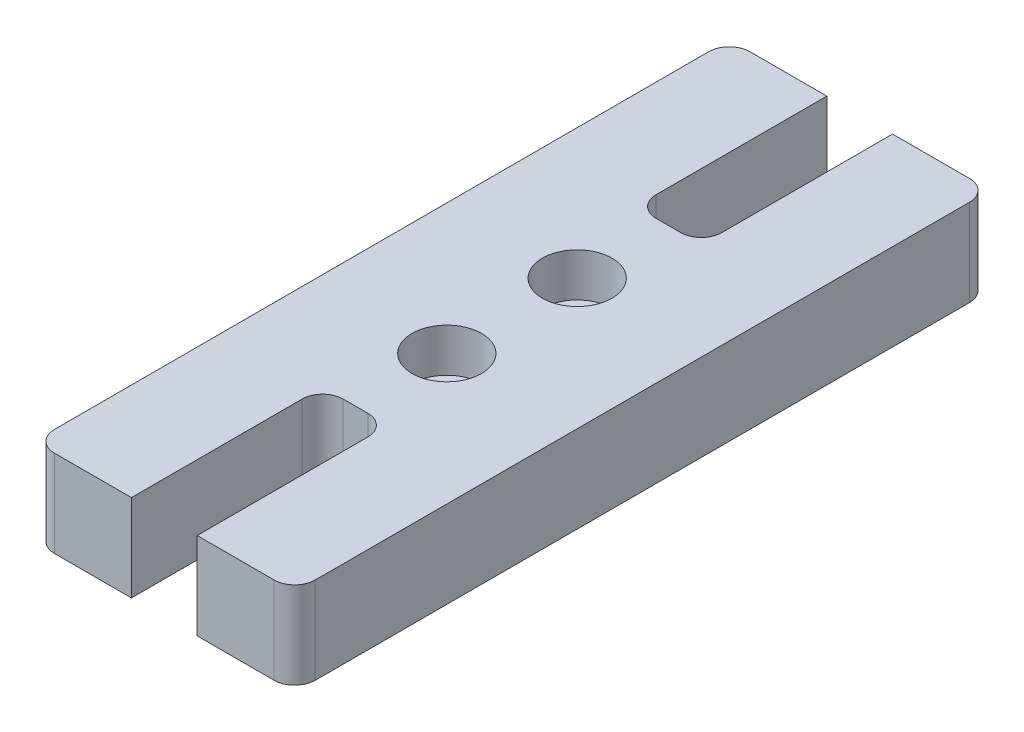
ISO-10303-21;
HEADER;
FILE_DESCRIPTION(('STEP AP214'),'2;1');
FILE_NAME('part.step','',(''),(''),'','','');
FILE_SCHEMA(('AUTOMOTIVE_DESIGN { 1 0 10303 214 1 1 1 1 }'));
ENDSEC;
DATA;
#1=APPLICATION_CONTEXT('core data for automotive mechanical design processes');
#2=APPLICATION_PROTOCOL_DEFINITION('international standard','automotive_design',2000,#1);
#3=PRODUCT_CONTEXT('',#1,'mechanical');
#4=PRODUCT('Part','Part','',(#3));
#5=PRODUCT_RELATED_PRODUCT_CATEGORY('part','',(#4));
#6=PRODUCT_DEFINITION_FORMATION('','',#4);
#7=PRODUCT_DEFINITION_CONTEXT('part definition',#1,'design');
#8=PRODUCT_DEFINITION('design','',#6,#7);
#9=PRODUCT_DEFINITION_SHAPE('','',#8);
#10=(LENGTH_UNIT() NAMED_UNIT(*) SI_UNIT(.MILLI.,.METRE.));
#11=(NAMED_UNIT(*) PLANE_ANGLE_UNIT() SI_UNIT($,.RADIAN.));
#12=(NAMED_UNIT(*) SI_UNIT($,.STERADIAN.) SOLID_ANGLE_UNIT());
#13=UNCERTAINTY_MEASURE_WITH_UNIT(LENGTH_MEASURE(1.E-05),#10,'distance_accuracy_value','');
#14=(GEOMETRIC_REPRESENTATION_CONTEXT(3) GLOBAL_UNCERTAINTY_ASSIGNED_CONTEXT((#13)) GLOBAL_UNIT_ASSIGNED_CONTEXT((#10,
#11,#12)) REPRESENTATION_CONTEXT('',''));
#15=CARTESIAN_POINT('',(0.,0.,0.));
#16=DIRECTION('',(0.,0.,1.));
#17=DIRECTION('',(1.,0.,0.));
#18=AXIS2_PLACEMENT_3D('',#15,#16,#17);
#19=CARTESIAN_POINT('',(-9.525,6.35,25.4));
#20=DIRECTION('',(0.,0.,-1.));
#21=DIRECTION('',(-1.,0.,0.));
#22=AXIS2_PLACEMENT_3D('',#19,#20,#21);
#23=PLANE('',#22);
#24=DIRECTION('',(1.,0.,0.));
#25=VECTOR('',#24,1.);
#26=CARTESIAN_POINT('',(-9.525,0.,25.4));
#27=LINE('',#26,#25);
#28=CARTESIAN_POINT('',(2.4003,0.,25.4));
#29=VERTEX_POINT('',#28);
#30=CARTESIAN_POINT('',(8.02499999999999,0.,25.4));
#31=VERTEX_POINT('',#30);
#32=EDGE_CURVE('E194',#29,#31,#27,.T.);
#33=ORIENTED_EDGE('',*,*,#32,.T.);
#34=DIRECTION('',(0.,-1.,0.));
#35=VECTOR('',#34,1.);
#36=CARTESIAN_POINT('',(8.025,6.35,25.4));
#37=LINE('',#36,#35);
#38=CARTESIAN_POINT('',(8.02499999999999,6.35,25.4));
#39=VERTEX_POINT('',#38);
#40=EDGE_CURVE('E341',#31,#39,#37,.F.);
#41=ORIENTED_EDGE('',*,*,#40,.T.);
#42=DIRECTION('',(1.,0.,0.));
#43=VECTOR('',#42,1.);
#44=CARTESIAN_POINT('',(-9.525,6.35,25.4));
#45=LINE('',#44,#43);
#46=CARTESIAN_POINT('',(2.4003,6.35,25.4));
#47=VERTEX_POINT('',#46);
#48=EDGE_CURVE('E301',#47,#39,#45,.T.);
#49=ORIENTED_EDGE('',*,*,#48,.F.);
#50=DIRECTION('',(0.,1.,0.));
#51=VECTOR('',#50,1.);
#52=CARTESIAN_POINT('',(2.4003,0.,25.4));
#53=LINE('',#52,#51);
#54=EDGE_CURVE('E205',#29,#47,#53,.T.);
#55=ORIENTED_EDGE('',*,*,#54,.F.);
#56=EDGE_LOOP('',(#33,#41,#49,#55));
#57=FACE_BOUND('',#56,.T.);
#58=ADVANCED_FACE('F43',(#57),#23,.F.);
#59=CARTESIAN_POINT('',(-8.025,6.35,25.4));
#60=VERTEX_POINT('',#59);
#61=CARTESIAN_POINT('',(-2.4003,6.35,25.4));
#62=VERTEX_POINT('',#61);
#63=EDGE_CURVE('E302',#60,#62,#45,.T.);
#64=ORIENTED_EDGE('',*,*,#63,.F.);
#65=DIRECTION('',(0.,-1.,0.));
#66=VECTOR('',#65,1.);
#67=CARTESIAN_POINT('',(-8.025,6.35,25.4));
#68=LINE('',#67,#66);
#69=CARTESIAN_POINT('',(-8.025,0.,25.4));
#70=VERTEX_POINT('',#69);
#71=EDGE_CURVE('E189',#60,#70,#68,.T.);
#72=ORIENTED_EDGE('',*,*,#71,.T.);
#73=CARTESIAN_POINT('',(-2.4003,0.,25.4));
#74=VERTEX_POINT('',#73);
#75=EDGE_CURVE('E183',#70,#74,#27,.T.);
#76=ORIENTED_EDGE('',*,*,#75,.T.);
#77=DIRECTION('',(0.,1.,0.));
#78=VECTOR('',#77,1.);
#79=CARTESIAN_POINT('',(-2.4003,0.,25.4));
#80=LINE('',#79,#78);
#81=EDGE_CURVE('E187',#74,#62,#80,.T.);
#82=ORIENTED_EDGE('',*,*,#81,.T.);
#83=EDGE_LOOP('',(#64,#72,#76,#82));
#84=FACE_BOUND('',#83,.T.);
#85=ADVANCED_FACE('F186',(#84),#23,.F.);
#86=CARTESIAN_POINT('',(0.,6.35,0.));
#87=DIRECTION('',(0.,-1.,0.));
#88=DIRECTION('',(0.,0.,-1.));
#89=AXIS2_PLACEMENT_3D('',#86,#87,#88);
#90=PLANE('',#89);
#91=CARTESIAN_POINT('',(0.,6.35,-4.7625));
#92=DIRECTION('',(0.,1.,0.));
#93=DIRECTION('',(0.,0.,1.));
#94=AXIS2_PLACEMENT_3D('',#91,#92,#93);
#95=CIRCLE('',#94,2.54);
#96=CARTESIAN_POINT('',(0.,6.35,-2.2225));
#97=VERTEX_POINT('',#96);
#98=EDGE_CURVE('E272',#97,#97,#95,.T.);
#99=ORIENTED_EDGE('',*,*,#98,.F.);
#100=EDGE_LOOP('',(#99));
#101=FACE_BOUND('',#100,.T.);
#102=CARTESIAN_POINT('',(0.,6.35,4.7625));
#103=DIRECTION('',(0.,-1.,0.));
#104=DIRECTION('',(0.,0.,-1.));
#105=AXIS2_PLACEMENT_3D('',#102,#103,#104);
#106=CIRCLE('',#105,2.54);
#107=CARTESIAN_POINT('',(0.,6.35,2.2225));
#108=VERTEX_POINT('',#107);
#109=EDGE_CURVE('E231',#108,#108,#106,.T.);
#110=ORIENTED_EDGE('',*,*,#109,.T.);
#111=EDGE_LOOP('',(#110));
#112=FACE_BOUND('',#111,.T.);
#113=ORIENTED_EDGE('',*,*,#48,.T.);
#114=CARTESIAN_POINT('',(8.025,6.35,23.9));
#115=DIRECTION('',(0.,-1.,0.));
#116=DIRECTION('',(0.,0.,-1.));
#117=AXIS2_PLACEMENT_3D('',#114,#115,#116);
#118=CIRCLE('',#117,1.5);
#119=CARTESIAN_POINT('',(9.525,6.35,23.9));
#120=VERTEX_POINT('',#119);
#121=EDGE_CURVE('E353',#39,#120,#118,.F.);
#122=ORIENTED_EDGE('',*,*,#121,.T.);
#123=DIRECTION('',(0.,0.,-1.));
#124=VECTOR('',#123,1.);
#125=CARTESIAN_POINT('',(9.525,6.35,25.4));
#126=LINE('',#125,#124);
#127=CARTESIAN_POINT('',(9.525,6.35,-23.9));
#128=VERTEX_POINT('',#127);
#129=EDGE_CURVE('E193',#120,#128,#126,.T.);
#130=ORIENTED_EDGE('',*,*,#129,.T.);
#131=CARTESIAN_POINT('',(8.025,6.35,-23.9));
#132=DIRECTION('',(0.,-1.,0.));
#133=DIRECTION('',(0.,0.,-1.));
#134=AXIS2_PLACEMENT_3D('',#131,#132,#133);
#135=CIRCLE('',#134,1.5);
#136=CARTESIAN_POINT('',(8.02499999999999,6.35,-25.4));
#137=VERTEX_POINT('',#136);
#138=EDGE_CURVE('E347',#128,#137,#135,.F.);
#139=ORIENTED_EDGE('',*,*,#138,.T.);
#140=DIRECTION('',(-1.,0.,0.));
#141=VECTOR('',#140,1.);
#142=CARTESIAN_POINT('',(-9.525,6.35,-25.4));
#143=LINE('',#142,#141);
#144=CARTESIAN_POINT('',(2.4003,6.35,-25.4));
#145=VERTEX_POINT('',#144);
#146=EDGE_CURVE('E293',#137,#145,#143,.T.);
#147=ORIENTED_EDGE('',*,*,#146,.T.);
#148=DIRECTION('',(0.,0.,-1.));
#149=VECTOR('',#148,1.);
#150=CARTESIAN_POINT('',(2.4003,6.35,-11.43));
#151=LINE('',#150,#149);
#152=CARTESIAN_POINT('',(2.4003,6.35,-12.93));
#153=VERTEX_POINT('',#152);
#154=EDGE_CURVE('E245',#153,#145,#151,.T.);
#155=ORIENTED_EDGE('',*,*,#154,.F.);
#156=CARTESIAN_POINT('',(0.9003,6.35,-12.93));
#157=DIRECTION('',(0.,-1.,0.));
#158=DIRECTION('',(0.,0.,-1.));
#159=AXIS2_PLACEMENT_3D('',#156,#157,#158);
#160=CIRCLE('',#159,1.5);
#161=CARTESIAN_POINT('',(0.9003,6.35,-11.43));
#162=VERTEX_POINT('',#161);
#163=EDGE_CURVE('E52',#153,#162,#160,.T.);
#164=ORIENTED_EDGE('',*,*,#163,.T.);
#165=DIRECTION('',(1.,0.,0.));
#166=VECTOR('',#165,1.);
#167=CARTESIAN_POINT('',(-2.4003,6.35,-11.43));
#168=LINE('',#167,#166);
#169=CARTESIAN_POINT('',(-0.9003,6.35,-11.43));
#170=VERTEX_POINT('',#169);
#171=EDGE_CURVE('E251',#170,#162,#168,.T.);
#172=ORIENTED_EDGE('',*,*,#171,.F.);
#173=CARTESIAN_POINT('',(-0.9003,6.35,-12.93));
#174=DIRECTION('',(0.,-1.,0.));
#175=DIRECTION('',(0.,0.,-1.));
#176=AXIS2_PLACEMENT_3D('',#173,#174,#175);
#177=CIRCLE('',#176,1.5);
#178=CARTESIAN_POINT('',(-2.4003,6.35,-12.93));
#179=VERTEX_POINT('',#178);
#180=EDGE_CURVE('E407',#170,#179,#177,.T.);
#181=ORIENTED_EDGE('',*,*,#180,.T.);
#182=DIRECTION('',(0.,0.,1.));
#183=VECTOR('',#182,1.);
#184=CARTESIAN_POINT('',(-2.4003,6.35,-11.43));
#185=LINE('',#184,#183);
#186=CARTESIAN_POINT('',(-2.4003,6.35,-25.4));
#187=VERTEX_POINT('',#186);
#188=EDGE_CURVE('E262',#187,#179,#185,.T.);
#189=ORIENTED_EDGE('',*,*,#188,.F.);
#190=CARTESIAN_POINT('',(-8.025,6.35,-25.4));
#191=VERTEX_POINT('',#190);
#192=EDGE_CURVE('E292',#187,#191,#143,.T.);
#193=ORIENTED_EDGE('',*,*,#192,.T.);
#194=CARTESIAN_POINT('',(-8.025,6.35,-23.9));
#195=DIRECTION('',(0.,-1.,0.));
#196=DIRECTION('',(0.,0.,-1.));
#197=AXIS2_PLACEMENT_3D('',#194,#195,#196);
#198=CIRCLE('',#197,1.5);
#199=CARTESIAN_POINT('',(-9.525,6.35,-23.9));
#200=VERTEX_POINT('',#199);
#201=EDGE_CURVE('E344',#191,#200,#198,.F.);
#202=ORIENTED_EDGE('',*,*,#201,.T.);
#203=DIRECTION('',(0.,0.,1.));
#204=VECTOR('',#203,1.);
#205=CARTESIAN_POINT('',(-9.525,6.35,25.4));
#206=LINE('',#205,#204);
#207=CARTESIAN_POINT('',(-9.525,6.35,23.9));
#208=VERTEX_POINT('',#207);
#209=EDGE_CURVE('E297',#200,#208,#206,.T.);
#210=ORIENTED_EDGE('',*,*,#209,.T.);
#211=CARTESIAN_POINT('',(-8.025,6.35,23.9));
#212=DIRECTION('',(0.,-1.,0.));
#213=DIRECTION('',(0.,0.,-1.));
#214=AXIS2_PLACEMENT_3D('',#211,#212,#213);
#215=CIRCLE('',#214,1.5);
#216=EDGE_CURVE('E350',#208,#60,#215,.F.);
#217=ORIENTED_EDGE('',*,*,#216,.T.);
#218=ORIENTED_EDGE('',*,*,#63,.T.);
#219=DIRECTION('',(0.,0.,-1.));
#220=VECTOR('',#219,1.);
#221=CARTESIAN_POINT('',(-2.4003,6.35,11.43));
#222=LINE('',#221,#220);
#223=CARTESIAN_POINT('',(-2.4003,6.35,12.93));
#224=VERTEX_POINT('',#223);
#225=EDGE_CURVE('E203',#62,#224,#222,.T.);
#226=ORIENTED_EDGE('',*,*,#225,.T.);
#227=CARTESIAN_POINT('',(-0.9003,6.35,12.93));
#228=DIRECTION('',(0.,-1.,0.));
#229=DIRECTION('',(0.,0.,-1.));
#230=AXIS2_PLACEMENT_3D('',#227,#228,#229);
#231=CIRCLE('',#230,1.5);
#232=CARTESIAN_POINT('',(-0.9003,6.35,11.43));
#233=VERTEX_POINT('',#232);
#234=EDGE_CURVE('E67',#224,#233,#231,.T.);
#235=ORIENTED_EDGE('',*,*,#234,.T.);
#236=DIRECTION('',(1.,0.,0.));
#237=VECTOR('',#236,1.);
#238=CARTESIAN_POINT('',(-2.4003,6.35,11.43));
#239=LINE('',#238,#237);
#240=CARTESIAN_POINT('',(0.9003,6.35,11.43));
#241=VERTEX_POINT('',#240);
#242=EDGE_CURVE('E224',#233,#241,#239,.T.);
#243=ORIENTED_EDGE('',*,*,#242,.T.);
#244=CARTESIAN_POINT('',(0.9003,6.35,12.93));
#245=DIRECTION('',(0.,-1.,0.));
#246=DIRECTION('',(0.,0.,-1.));
#247=AXIS2_PLACEMENT_3D('',#244,#245,#246);
#248=CIRCLE('',#247,1.5);
#249=CARTESIAN_POINT('',(2.4003,6.35,12.93));
#250=VERTEX_POINT('',#249);
#251=EDGE_CURVE('E59',#241,#250,#248,.T.);
#252=ORIENTED_EDGE('',*,*,#251,.T.);
#253=DIRECTION('',(0.,0.,1.));
#254=VECTOR('',#253,1.);
#255=CARTESIAN_POINT('',(2.4003,6.35,11.43));
#256=LINE('',#255,#254);
#257=EDGE_CURVE('E221',#250,#47,#256,.T.);
#258=ORIENTED_EDGE('',*,*,#257,.T.);
#259=EDGE_LOOP('',(#113,#122,#130,#139,#147,#155,#164,#172,#181,#189,#193,#202,#210,#217,#218,
#226,#235,#243,#252,#258));
#260=FACE_BOUND('',#259,.T.);
#261=ADVANCED_FACE('F416',(#101,#112,#260),#90,.F.);
#262=CARTESIAN_POINT('',(0.,0.,0.));
#263=DIRECTION('',(0.,-1.,0.));
#264=DIRECTION('',(0.,0.,-1.));
#265=AXIS2_PLACEMENT_3D('',#262,#263,#264);
#266=PLANE('',#265);
#267=CARTESIAN_POINT('',(0.,0.,4.7625));
#268=DIRECTION('',(0.,-1.,0.));
#269=DIRECTION('',(0.,0.,-1.));
#270=AXIS2_PLACEMENT_3D('',#267,#268,#269);
#271=CIRCLE('',#270,1.7272);
#272=CARTESIAN_POINT('',(0.,0.,3.0353));
#273=VERTEX_POINT('',#272);
#274=EDGE_CURVE('E241',#273,#273,#271,.T.);
#275=ORIENTED_EDGE('',*,*,#274,.F.);
#276=EDGE_LOOP('',(#275));
#277=FACE_BOUND('',#276,.T.);
#278=CARTESIAN_POINT('',(0.,0.,-4.7625));
#279=DIRECTION('',(0.,1.,0.));
#280=DIRECTION('',(0.,0.,1.));
#281=AXIS2_PLACEMENT_3D('',#278,#279,#280);
#282=CIRCLE('',#281,1.7272);
#283=CARTESIAN_POINT('',(0.,0.,-3.0353));
#284=VERTEX_POINT('',#283);
#285=EDGE_CURVE('E284',#284,#284,#282,.T.);
#286=ORIENTED_EDGE('',*,*,#285,.T.);
#287=EDGE_LOOP('',(#286));
#288=FACE_BOUND('',#287,.T.);
#289=DIRECTION('',(0.,0.,-1.));
#290=VECTOR('',#289,1.);
#291=CARTESIAN_POINT('',(9.525,0.,25.4));
#292=LINE('',#291,#290);
#293=CARTESIAN_POINT('',(9.525,0.,23.9));
#294=VERTEX_POINT('',#293);
#295=CARTESIAN_POINT('',(9.525,0.,-23.9));
#296=VERTEX_POINT('',#295);
#297=EDGE_CURVE('E288',#294,#296,#292,.T.);
#298=ORIENTED_EDGE('',*,*,#297,.F.);
#299=CARTESIAN_POINT('',(8.025,0.,23.9));
#300=DIRECTION('',(0.,-1.,0.));
#301=DIRECTION('',(0.,0.,-1.));
#302=AXIS2_PLACEMENT_3D('',#299,#300,#301);
#303=CIRCLE('',#302,1.5);
#304=EDGE_CURVE('E338',#294,#31,#303,.T.);
#305=ORIENTED_EDGE('',*,*,#304,.T.);
#306=ORIENTED_EDGE('',*,*,#32,.F.);
#307=DIRECTION('',(0.,0.,1.));
#308=VECTOR('',#307,1.);
#309=CARTESIAN_POINT('',(2.4003,0.,11.43));
#310=LINE('',#309,#308);
#311=CARTESIAN_POINT('',(2.4003,0.,12.93));
#312=VERTEX_POINT('',#311);
#313=EDGE_CURVE('E217',#312,#29,#310,.T.);
#314=ORIENTED_EDGE('',*,*,#313,.F.);
#315=CARTESIAN_POINT('',(0.9003,0.,12.93));
#316=DIRECTION('',(0.,-1.,0.));
#317=DIRECTION('',(0.,0.,-1.));
#318=AXIS2_PLACEMENT_3D('',#315,#316,#317);
#319=CIRCLE('',#318,1.5);
#320=CARTESIAN_POINT('',(0.9003,0.,11.43));
#321=VERTEX_POINT('',#320);
#322=EDGE_CURVE('E400',#312,#321,#319,.F.);
#323=ORIENTED_EDGE('',*,*,#322,.T.);
#324=DIRECTION('',(1.,0.,0.));
#325=VECTOR('',#324,1.);
#326=CARTESIAN_POINT('',(-2.4003,0.,11.43));
#327=LINE('',#326,#325);
#328=CARTESIAN_POINT('',(-0.9003,0.,11.43));
#329=VERTEX_POINT('',#328);
#330=EDGE_CURVE('E213',#329,#321,#327,.T.);
#331=ORIENTED_EDGE('',*,*,#330,.F.);
#332=CARTESIAN_POINT('',(-0.9003,0.,12.93));
#333=DIRECTION('',(0.,-1.,0.));
#334=DIRECTION('',(0.,0.,-1.));
#335=AXIS2_PLACEMENT_3D('',#332,#333,#334);
#336=CIRCLE('',#335,1.5);
#337=CARTESIAN_POINT('',(-2.4003,0.,12.93));
#338=VERTEX_POINT('',#337);
#339=EDGE_CURVE('E211',#329,#338,#336,.F.);
#340=ORIENTED_EDGE('',*,*,#339,.T.);
#341=DIRECTION('',(0.,0.,-1.));
#342=VECTOR('',#341,1.);
#343=CARTESIAN_POINT('',(-2.4003,0.,11.43));
#344=LINE('',#343,#342);
#345=EDGE_CURVE('E201',#74,#338,#344,.T.);
#346=ORIENTED_EDGE('',*,*,#345,.F.);
#347=ORIENTED_EDGE('',*,*,#75,.F.);
#348=CARTESIAN_POINT('',(-8.025,0.,23.9));
#349=DIRECTION('',(0.,-1.,0.));
#350=DIRECTION('',(0.,0.,-1.));
#351=AXIS2_PLACEMENT_3D('',#348,#349,#350);
#352=CIRCLE('',#351,1.5);
#353=CARTESIAN_POINT('',(-9.525,0.,23.9));
#354=VERTEX_POINT('',#353);
#355=EDGE_CURVE('E335',#70,#354,#352,.T.);
#356=ORIENTED_EDGE('',*,*,#355,.T.);
#357=DIRECTION('',(0.,0.,1.));
#358=VECTOR('',#357,1.);
#359=CARTESIAN_POINT('',(-9.525,0.,25.4));
#360=LINE('',#359,#358);
#361=CARTESIAN_POINT('',(-9.525,0.,-23.9));
#362=VERTEX_POINT('',#361);
#363=EDGE_CURVE('E313',#362,#354,#360,.T.);
#364=ORIENTED_EDGE('',*,*,#363,.F.);
#365=CARTESIAN_POINT('',(-8.025,0.,-23.9));
#366=DIRECTION('',(0.,-1.,0.));
#367=DIRECTION('',(0.,0.,-1.));
#368=AXIS2_PLACEMENT_3D('',#365,#366,#367);
#369=CIRCLE('',#368,1.5);
#370=CARTESIAN_POINT('',(-8.025,0.,-25.4));
#371=VERTEX_POINT('',#370);
#372=EDGE_CURVE('E329',#362,#371,#369,.T.);
#373=ORIENTED_EDGE('',*,*,#372,.T.);
#374=DIRECTION('',(-1.,0.,0.));
#375=VECTOR('',#374,1.);
#376=CARTESIAN_POINT('',(-9.525,0.,-25.4));
#377=LINE('',#376,#375);
#378=CARTESIAN_POINT('',(-2.4003,0.,-25.4));
#379=VERTEX_POINT('',#378);
#380=EDGE_CURVE('E309',#379,#371,#377,.T.);
#381=ORIENTED_EDGE('',*,*,#380,.F.);
#382=DIRECTION('',(0.,0.,1.));
#383=VECTOR('',#382,1.);
#384=CARTESIAN_POINT('',(-2.4003,0.,-11.43));
#385=LINE('',#384,#383);
#386=CARTESIAN_POINT('',(-2.4003,0.,-12.93));
#387=VERTEX_POINT('',#386);
#388=EDGE_CURVE('E250',#379,#387,#385,.T.);
#389=ORIENTED_EDGE('',*,*,#388,.T.);
#390=CARTESIAN_POINT('',(-0.9003,0.,-12.93));
#391=DIRECTION('',(0.,-1.,0.));
#392=DIRECTION('',(0.,0.,-1.));
#393=AXIS2_PLACEMENT_3D('',#390,#391,#392);
#394=CIRCLE('',#393,1.5);
#395=CARTESIAN_POINT('',(-0.9003,0.,-11.43));
#396=VERTEX_POINT('',#395);
#397=EDGE_CURVE('E410',#387,#396,#394,.F.);
#398=ORIENTED_EDGE('',*,*,#397,.T.);
#399=DIRECTION('',(1.,0.,0.));
#400=VECTOR('',#399,1.);
#401=CARTESIAN_POINT('',(-2.4003,0.,-11.43));
#402=LINE('',#401,#400);
#403=CARTESIAN_POINT('',(0.9003,0.,-11.43));
#404=VERTEX_POINT('',#403);
#405=EDGE_CURVE('E255',#396,#404,#402,.T.);
#406=ORIENTED_EDGE('',*,*,#405,.T.);
#407=CARTESIAN_POINT('',(0.9003,0.,-12.93));
#408=DIRECTION('',(0.,-1.,0.));
#409=DIRECTION('',(0.,0.,-1.));
#410=AXIS2_PLACEMENT_3D('',#407,#408,#409);
#411=CIRCLE('',#410,1.5);
#412=CARTESIAN_POINT('',(2.4003,0.,-12.93));
#413=VERTEX_POINT('',#412);
#414=EDGE_CURVE('E11',#404,#413,#411,.F.);
#415=ORIENTED_EDGE('',*,*,#414,.T.);
#416=DIRECTION('',(0.,0.,-1.));
#417=VECTOR('',#416,1.);
#418=CARTESIAN_POINT('',(2.4003,0.,-11.43));
#419=LINE('',#418,#417);
#420=CARTESIAN_POINT('',(2.4003,0.,-25.4));
#421=VERTEX_POINT('',#420);
#422=EDGE_CURVE('E246',#413,#421,#419,.T.);
#423=ORIENTED_EDGE('',*,*,#422,.T.);
#424=CARTESIAN_POINT('',(8.02499999999999,0.,-25.4));
#425=VERTEX_POINT('',#424);
#426=EDGE_CURVE('E310',#425,#421,#377,.T.);
#427=ORIENTED_EDGE('',*,*,#426,.F.);
#428=CARTESIAN_POINT('',(8.025,0.,-23.9));
#429=DIRECTION('',(0.,-1.,0.));
#430=DIRECTION('',(0.,0.,-1.));
#431=AXIS2_PLACEMENT_3D('',#428,#429,#430);
#432=CIRCLE('',#431,1.5);
#433=EDGE_CURVE('E332',#425,#296,#432,.T.);
#434=ORIENTED_EDGE('',*,*,#433,.T.);
#435=EDGE_LOOP('',(#298,#305,#306,#314,#323,#331,#340,#346,#347,#356,#364,#373,#381,#389,#398,
#406,#415,#423,#427,#434));
#436=FACE_BOUND('',#435,.T.);
#437=ADVANCED_FACE('F208',(#277,#288,#436),#266,.T.);
#438=CARTESIAN_POINT('',(0.,0.,4.7625));
#439=DIRECTION('',(0.,1.,0.));
#440=DIRECTION('',(0.,0.,1.));
#441=AXIS2_PLACEMENT_3D('',#438,#439,#440);
#442=CYLINDRICAL_SURFACE('',#441,1.7272);
#443=ORIENTED_EDGE('',*,*,#274,.T.);
#444=EDGE_LOOP('',(#443));
#445=FACE_BOUND('',#444,.T.);
#446=CARTESIAN_POINT('',(0.,3.175,4.7625));
#447=DIRECTION('',(0.,1.,0.));
#448=DIRECTION('',(0.,0.,1.));
#449=AXIS2_PLACEMENT_3D('',#446,#447,#448);
#450=CIRCLE('',#449,1.7272);
#451=CARTESIAN_POINT('',(0.,3.175,6.4897));
#452=VERTEX_POINT('',#451);
#453=EDGE_CURVE('E237',#452,#452,#450,.T.);
#454=ORIENTED_EDGE('',*,*,#453,.T.);
#455=EDGE_LOOP('',(#454));
#456=FACE_BOUND('',#455,.T.);
#457=ADVANCED_FACE('F509',(#445,#456),#442,.F.);
#458=CARTESIAN_POINT('',(-9.525,6.35,-25.4));
#459=DIRECTION('',(0.,0.,1.));
#460=DIRECTION('',(1.,0.,0.));
#461=AXIS2_PLACEMENT_3D('',#458,#459,#460);
#462=PLANE('',#461);
#463=ORIENTED_EDGE('',*,*,#146,.F.);
#464=DIRECTION('',(0.,-1.,0.));
#465=VECTOR('',#464,1.);
#466=CARTESIAN_POINT('',(8.025,6.35,-25.4));
#467=LINE('',#466,#465);
#468=EDGE_CURVE('E391',#137,#425,#467,.T.);
#469=ORIENTED_EDGE('',*,*,#468,.T.);
#470=ORIENTED_EDGE('',*,*,#426,.T.);
#471=DIRECTION('',(0.,1.,0.));
#472=VECTOR('',#471,1.);
#473=CARTESIAN_POINT('',(2.4003,0.,-25.4));
#474=LINE('',#473,#472);
#475=EDGE_CURVE('E259',#421,#145,#474,.T.);
#476=ORIENTED_EDGE('',*,*,#475,.T.);
#477=EDGE_LOOP('',(#463,#469,#470,#476));
#478=FACE_BOUND('',#477,.T.);
#479=ADVANCED_FACE('F433',(#478),#462,.F.);
#480=CARTESIAN_POINT('',(0.,0.,-4.7625));
#481=DIRECTION('',(0.,1.,0.));
#482=DIRECTION('',(0.,0.,1.));
#483=AXIS2_PLACEMENT_3D('',#480,#481,#482);
#484=CYLINDRICAL_SURFACE('',#483,1.7272);
#485=ORIENTED_EDGE('',*,*,#285,.F.);
#486=EDGE_LOOP('',(#485));
#487=FACE_BOUND('',#486,.T.);
#488=CARTESIAN_POINT('',(0.,3.175,-4.7625));
#489=DIRECTION('',(0.,1.,0.));
#490=DIRECTION('',(0.,0.,1.));
#491=AXIS2_PLACEMENT_3D('',#488,#489,#490);
#492=CIRCLE('',#491,1.7272);
#493=CARTESIAN_POINT('',(0.,3.175,-3.0353));
#494=VERTEX_POINT('',#493);
#495=EDGE_CURVE('E280',#494,#494,#492,.F.);
#496=ORIENTED_EDGE('',*,*,#495,.F.);
#497=EDGE_LOOP('',(#496));
#498=FACE_BOUND('',#497,.T.);
#499=ADVANCED_FACE('F500',(#487,#498),#484,.F.);
#500=CARTESIAN_POINT('',(9.525,6.35,25.4));
#501=DIRECTION('',(-1.,0.,0.));
#502=DIRECTION('',(0.,0.,1.));
#503=AXIS2_PLACEMENT_3D('',#500,#501,#502);
#504=PLANE('',#503);
#505=ORIENTED_EDGE('',*,*,#129,.F.);
#506=DIRECTION('',(0.,-1.,0.));
#507=VECTOR('',#506,1.);
#508=CARTESIAN_POINT('',(9.525,6.35,23.9));
#509=LINE('',#508,#507);
#510=EDGE_CURVE('E325',#120,#294,#509,.T.);
#511=ORIENTED_EDGE('',*,*,#510,.T.);
#512=ORIENTED_EDGE('',*,*,#297,.T.);
#513=DIRECTION('',(0.,-1.,0.));
#514=VECTOR('',#513,1.);
#515=CARTESIAN_POINT('',(9.525,6.35,-23.9));
#516=LINE('',#515,#514);
#517=EDGE_CURVE('E305',#296,#128,#516,.F.);
#518=ORIENTED_EDGE('',*,*,#517,.T.);
#519=EDGE_LOOP('',(#505,#511,#512,#518));
#520=FACE_BOUND('',#519,.T.);
#521=ADVANCED_FACE('F439',(#520),#504,.F.);
#522=ORIENTED_EDGE('',*,*,#380,.T.);
#523=DIRECTION('',(0.,-1.,0.));
#524=VECTOR('',#523,1.);
#525=CARTESIAN_POINT('',(-8.025,6.35,-25.4));
#526=LINE('',#525,#524);
#527=EDGE_CURVE('E395',#371,#191,#526,.F.);
#528=ORIENTED_EDGE('',*,*,#527,.T.);
#529=ORIENTED_EDGE('',*,*,#192,.F.);
#530=DIRECTION('',(0.,1.,0.));
#531=VECTOR('',#530,1.);
#532=CARTESIAN_POINT('',(-2.4003,0.,-25.4));
#533=LINE('',#532,#531);
#534=EDGE_CURVE('E269',#379,#187,#533,.T.);
#535=ORIENTED_EDGE('',*,*,#534,.F.);
#536=EDGE_LOOP('',(#522,#528,#529,#535));
#537=FACE_BOUND('',#536,.T.);
#538=ADVANCED_FACE('F460',(#537),#462,.F.);
#539=CARTESIAN_POINT('',(-9.525,6.35,25.4));
#540=DIRECTION('',(1.,0.,0.));
#541=DIRECTION('',(0.,0.,-1.));
#542=AXIS2_PLACEMENT_3D('',#539,#540,#541);
#543=PLANE('',#542);
#544=ORIENTED_EDGE('',*,*,#363,.T.);
#545=DIRECTION('',(0.,-1.,0.));
#546=VECTOR('',#545,1.);
#547=CARTESIAN_POINT('',(-9.525,6.35,23.9));
#548=LINE('',#547,#546);
#549=EDGE_CURVE('E362',#354,#208,#548,.F.);
#550=ORIENTED_EDGE('',*,*,#549,.T.);
#551=ORIENTED_EDGE('',*,*,#209,.F.);
#552=DIRECTION('',(0.,-1.,0.));
#553=VECTOR('',#552,1.);
#554=CARTESIAN_POINT('',(-9.525,6.35,-23.9));
#555=LINE('',#554,#553);
#556=EDGE_CURVE('E358',#200,#362,#555,.T.);
#557=ORIENTED_EDGE('',*,*,#556,.T.);
#558=EDGE_LOOP('',(#544,#550,#551,#557));
#559=FACE_BOUND('',#558,.T.);
#560=ADVANCED_FACE('F470',(#559),#543,.F.);
#561=CARTESIAN_POINT('',(0.,3.175,-4.7625));
#562=DIRECTION('',(0.,1.,0.));
#563=DIRECTION('',(0.,0.,1.));
#564=AXIS2_PLACEMENT_3D('',#561,#562,#563);
#565=PLANE('',#564);
#566=CARTESIAN_POINT('',(0.,3.175,-4.7625));
#567=DIRECTION('',(0.,1.,0.));
#568=DIRECTION('',(0.,0.,1.));
#569=AXIS2_PLACEMENT_3D('',#566,#567,#568);
#570=CIRCLE('',#569,2.54);
#571=CARTESIAN_POINT('',(0.,3.175,-2.2225));
#572=VERTEX_POINT('',#571);
#573=EDGE_CURVE('E276',#572,#572,#570,.T.);
#574=ORIENTED_EDGE('',*,*,#573,.T.);
#575=EDGE_LOOP('',(#574));
#576=FACE_BOUND('',#575,.T.);
#577=ORIENTED_EDGE('',*,*,#495,.T.);
#578=EDGE_LOOP('',(#577));
#579=FACE_BOUND('',#578,.T.);
#580=ADVANCED_FACE('F496',(#576,#579),#565,.T.);
#581=CARTESIAN_POINT('',(0.,3.175,-4.7625));
#582=DIRECTION('',(0.,1.,0.));
#583=DIRECTION('',(0.,0.,1.));
#584=AXIS2_PLACEMENT_3D('',#581,#582,#583);
#585=CYLINDRICAL_SURFACE('',#584,2.54);
#586=ORIENTED_EDGE('',*,*,#573,.F.);
#587=EDGE_LOOP('',(#586));
#588=FACE_BOUND('',#587,.T.);
#589=ORIENTED_EDGE('',*,*,#98,.T.);
#590=EDGE_LOOP('',(#589));
#591=FACE_BOUND('',#590,.T.);
#592=ADVANCED_FACE('F513',(#588,#591),#585,.F.);
#593=CARTESIAN_POINT('',(2.4003,0.,-11.43));
#594=DIRECTION('',(1.,0.,0.));
#595=DIRECTION('',(0.,0.,-1.));
#596=AXIS2_PLACEMENT_3D('',#593,#594,#595);
#597=PLANE('',#596);
#598=ORIENTED_EDGE('',*,*,#422,.F.);
#599=DIRECTION('',(0.,1.,0.));
#600=VECTOR('',#599,1.);
#601=CARTESIAN_POINT('',(2.4003,6.35,-12.93));
#602=LINE('',#601,#600);
#603=EDGE_CURVE('E387',#413,#153,#602,.T.);
#604=ORIENTED_EDGE('',*,*,#603,.T.);
#605=ORIENTED_EDGE('',*,*,#154,.T.);
#606=ORIENTED_EDGE('',*,*,#475,.F.);
#607=EDGE_LOOP('',(#598,#604,#605,#606));
#608=FACE_BOUND('',#607,.T.);
#609=ADVANCED_FACE('F430',(#608),#597,.F.);
#610=CARTESIAN_POINT('',(-2.4003,0.,-11.43));
#611=DIRECTION('',(0.,0.,1.));
#612=DIRECTION('',(1.,0.,0.));
#613=AXIS2_PLACEMENT_3D('',#610,#611,#612);
#614=PLANE('',#613);
#615=ORIENTED_EDGE('',*,*,#405,.F.);
#616=DIRECTION('',(0.,1.,0.));
#617=VECTOR('',#616,1.);
#618=CARTESIAN_POINT('',(-0.9003,6.35,-11.43));
#619=LINE('',#618,#617);
#620=EDGE_CURVE('E380',#396,#170,#619,.T.);
#621=ORIENTED_EDGE('',*,*,#620,.T.);
#622=ORIENTED_EDGE('',*,*,#171,.T.);
#623=DIRECTION('',(0.,1.,0.));
#624=VECTOR('',#623,1.);
#625=CARTESIAN_POINT('',(0.9003,0.,-11.43));
#626=LINE('',#625,#624);
#627=EDGE_CURVE('E377',#162,#404,#626,.F.);
#628=ORIENTED_EDGE('',*,*,#627,.T.);
#629=EDGE_LOOP('',(#615,#621,#622,#628));
#630=FACE_BOUND('',#629,.T.);
#631=ADVANCED_FACE('F422',(#630),#614,.F.);
#632=CARTESIAN_POINT('',(-2.4003,0.,-11.43));
#633=DIRECTION('',(-1.,0.,0.));
#634=DIRECTION('',(0.,0.,1.));
#635=AXIS2_PLACEMENT_3D('',#632,#633,#634);
#636=PLANE('',#635);
#637=ORIENTED_EDGE('',*,*,#188,.T.);
#638=DIRECTION('',(0.,1.,0.));
#639=VECTOR('',#638,1.);
#640=CARTESIAN_POINT('',(-2.4003,0.,-12.93));
#641=LINE('',#640,#639);
#642=EDGE_CURVE('E384',#179,#387,#641,.F.);
#643=ORIENTED_EDGE('',*,*,#642,.T.);
#644=ORIENTED_EDGE('',*,*,#388,.F.);
#645=ORIENTED_EDGE('',*,*,#534,.T.);
#646=EDGE_LOOP('',(#637,#643,#644,#645));
#647=FACE_BOUND('',#646,.T.);
#648=ADVANCED_FACE('F528',(#647),#636,.F.);
#649=CARTESIAN_POINT('',(0.,3.175,4.7625));
#650=DIRECTION('',(0.,1.,0.));
#651=DIRECTION('',(0.,0.,1.));
#652=AXIS2_PLACEMENT_3D('',#649,#650,#651);
#653=CYLINDRICAL_SURFACE('',#652,2.54);
#654=CARTESIAN_POINT('',(0.,3.175,4.7625));
#655=DIRECTION('',(0.,-1.,0.));
#656=DIRECTION('',(0.,0.,-1.));
#657=AXIS2_PLACEMENT_3D('',#654,#655,#656);
#658=CIRCLE('',#657,2.54);
#659=CARTESIAN_POINT('',(0.,3.175,2.2225));
#660=VERTEX_POINT('',#659);
#661=EDGE_CURVE('E233',#660,#660,#658,.T.);
#662=ORIENTED_EDGE('',*,*,#661,.T.);
#663=EDGE_LOOP('',(#662));
#664=FACE_BOUND('',#663,.T.);
#665=ORIENTED_EDGE('',*,*,#109,.F.);
#666=EDGE_LOOP('',(#665));
#667=FACE_BOUND('',#666,.T.);
#668=ADVANCED_FACE('F525',(#664,#667),#653,.F.);
#669=CARTESIAN_POINT('',(0.,3.175,4.7625));
#670=DIRECTION('',(0.,1.,0.));
#671=DIRECTION('',(0.,0.,-1.));
#672=AXIS2_PLACEMENT_3D('',#669,#670,#671);
#673=PLANE('',#672);
#674=ORIENTED_EDGE('',*,*,#453,.F.);
#675=EDGE_LOOP('',(#674));
#676=FACE_BOUND('',#675,.T.);
#677=ORIENTED_EDGE('',*,*,#661,.F.);
#678=EDGE_LOOP('',(#677));
#679=FACE_BOUND('',#678,.T.);
#680=ADVANCED_FACE('F527',(#676,#679),#673,.T.);
#681=CARTESIAN_POINT('',(2.4003,0.,11.43));
#682=DIRECTION('',(-1.,0.,0.));
#683=DIRECTION('',(0.,0.,1.));
#684=AXIS2_PLACEMENT_3D('',#681,#682,#683);
#685=PLANE('',#684);
#686=ORIENTED_EDGE('',*,*,#257,.F.);
#687=DIRECTION('',(0.,1.,0.));
#688=VECTOR('',#687,1.);
#689=CARTESIAN_POINT('',(2.4003,0.,12.93));
#690=LINE('',#689,#688);
#691=EDGE_CURVE('E371',#250,#312,#690,.F.);
#692=ORIENTED_EDGE('',*,*,#691,.T.);
#693=ORIENTED_EDGE('',*,*,#313,.T.);
#694=ORIENTED_EDGE('',*,*,#54,.T.);
#695=EDGE_LOOP('',(#686,#692,#693,#694));
#696=FACE_BOUND('',#695,.T.);
#697=ADVANCED_FACE('F535',(#696),#685,.T.);
#698=CARTESIAN_POINT('',(-2.4003,0.,11.43));
#699=DIRECTION('',(1.,0.,0.));
#700=DIRECTION('',(0.,0.,-1.));
#701=AXIS2_PLACEMENT_3D('',#698,#699,#700);
#702=PLANE('',#701);
#703=ORIENTED_EDGE('',*,*,#345,.T.);
#704=DIRECTION('',(0.,1.,0.));
#705=VECTOR('',#704,1.);
#706=CARTESIAN_POINT('',(-2.4003,6.35,12.93));
#707=LINE('',#706,#705);
#708=EDGE_CURVE('E374',#338,#224,#707,.T.);
#709=ORIENTED_EDGE('',*,*,#708,.T.);
#710=ORIENTED_EDGE('',*,*,#225,.F.);
#711=ORIENTED_EDGE('',*,*,#81,.F.);
#712=EDGE_LOOP('',(#703,#709,#710,#711));
#713=FACE_BOUND('',#712,.T.);
#714=ADVANCED_FACE('F199',(#713),#702,.T.);
#715=CARTESIAN_POINT('',(-2.4003,0.,11.43));
#716=DIRECTION('',(0.,0.,1.));
#717=DIRECTION('',(1.,0.,0.));
#718=AXIS2_PLACEMENT_3D('',#715,#716,#717);
#719=PLANE('',#718);
#720=ORIENTED_EDGE('',*,*,#330,.T.);
#721=DIRECTION('',(0.,1.,0.));
#722=VECTOR('',#721,1.);
#723=CARTESIAN_POINT('',(0.9003,6.35,11.43));
#724=LINE('',#723,#722);
#725=EDGE_CURVE('E368',#321,#241,#724,.T.);
#726=ORIENTED_EDGE('',*,*,#725,.T.);
#727=ORIENTED_EDGE('',*,*,#242,.F.);
#728=DIRECTION('',(0.,1.,0.));
#729=VECTOR('',#728,1.);
#730=CARTESIAN_POINT('',(-0.9003,0.,11.43));
#731=LINE('',#730,#729);
#732=EDGE_CURVE('E365',#233,#329,#731,.F.);
#733=ORIENTED_EDGE('',*,*,#732,.T.);
#734=EDGE_LOOP('',(#720,#726,#727,#733));
#735=FACE_BOUND('',#734,.T.);
#736=ADVANCED_FACE('F484',(#735),#719,.T.);
#737=CARTESIAN_POINT('',(8.025,6.35,23.9));
#738=DIRECTION('',(0.,-1.,0.));
#739=DIRECTION('',(0.,0.,-1.));
#740=AXIS2_PLACEMENT_3D('',#737,#738,#739);
#741=CYLINDRICAL_SURFACE('',#740,1.5);
#742=ORIENTED_EDGE('',*,*,#121,.F.);
#743=ORIENTED_EDGE('',*,*,#40,.F.);
#744=ORIENTED_EDGE('',*,*,#304,.F.);
#745=ORIENTED_EDGE('',*,*,#510,.F.);
#746=EDGE_LOOP('',(#742,#743,#744,#745));
#747=FACE_BOUND('',#746,.T.);
#748=ADVANCED_FACE('F445',(#747),#741,.T.);
#749=CARTESIAN_POINT('',(-8.025,6.35,23.9));
#750=DIRECTION('',(0.,-1.,0.));
#751=DIRECTION('',(0.,0.,-1.));
#752=AXIS2_PLACEMENT_3D('',#749,#750,#751);
#753=CYLINDRICAL_SURFACE('',#752,1.5);
#754=ORIENTED_EDGE('',*,*,#216,.F.);
#755=ORIENTED_EDGE('',*,*,#549,.F.);
#756=ORIENTED_EDGE('',*,*,#355,.F.);
#757=ORIENTED_EDGE('',*,*,#71,.F.);
#758=EDGE_LOOP('',(#754,#755,#756,#757));
#759=FACE_BOUND('',#758,.T.);
#760=ADVANCED_FACE('F474',(#759),#753,.T.);
#761=CARTESIAN_POINT('',(0.9003,0.,12.93));
#762=DIRECTION('',(0.,-1.,0.));
#763=DIRECTION('',(0.,0.,-1.));
#764=AXIS2_PLACEMENT_3D('',#761,#762,#763);
#765=CYLINDRICAL_SURFACE('',#764,1.5);
#766=ORIENTED_EDGE('',*,*,#322,.F.);
#767=ORIENTED_EDGE('',*,*,#691,.F.);
#768=ORIENTED_EDGE('',*,*,#251,.F.);
#769=ORIENTED_EDGE('',*,*,#725,.F.);
#770=EDGE_LOOP('',(#766,#767,#768,#769));
#771=FACE_BOUND('',#770,.T.);
#772=ADVANCED_FACE('F476',(#771),#765,.F.);
#773=CARTESIAN_POINT('',(-0.9003,0.,12.93));
#774=DIRECTION('',(0.,-1.,0.));
#775=DIRECTION('',(0.,0.,-1.));
#776=AXIS2_PLACEMENT_3D('',#773,#774,#775);
#777=CYLINDRICAL_SURFACE('',#776,1.5);
#778=ORIENTED_EDGE('',*,*,#339,.F.);
#779=ORIENTED_EDGE('',*,*,#732,.F.);
#780=ORIENTED_EDGE('',*,*,#234,.F.);
#781=ORIENTED_EDGE('',*,*,#708,.F.);
#782=EDGE_LOOP('',(#778,#779,#780,#781));
#783=FACE_BOUND('',#782,.T.);
#784=ADVANCED_FACE('F482',(#783),#777,.F.);
#785=CARTESIAN_POINT('',(-0.9003,0.,-12.93));
#786=DIRECTION('',(0.,-1.,0.));
#787=DIRECTION('',(0.,0.,-1.));
#788=AXIS2_PLACEMENT_3D('',#785,#786,#787);
#789=CYLINDRICAL_SURFACE('',#788,1.5);
#790=ORIENTED_EDGE('',*,*,#397,.F.);
#791=ORIENTED_EDGE('',*,*,#642,.F.);
#792=ORIENTED_EDGE('',*,*,#180,.F.);
#793=ORIENTED_EDGE('',*,*,#620,.F.);
#794=EDGE_LOOP('',(#790,#791,#792,#793));
#795=FACE_BOUND('',#794,.T.);
#796=ADVANCED_FACE('F633',(#795),#789,.F.);
#797=CARTESIAN_POINT('',(0.9003,0.,-12.93));
#798=DIRECTION('',(0.,-1.,0.));
#799=DIRECTION('',(0.,0.,-1.));
#800=AXIS2_PLACEMENT_3D('',#797,#798,#799);
#801=CYLINDRICAL_SURFACE('',#800,1.5);
#802=ORIENTED_EDGE('',*,*,#414,.F.);
#803=ORIENTED_EDGE('',*,*,#627,.F.);
#804=ORIENTED_EDGE('',*,*,#163,.F.);
#805=ORIENTED_EDGE('',*,*,#603,.F.);
#806=EDGE_LOOP('',(#802,#803,#804,#805));
#807=FACE_BOUND('',#806,.T.);
#808=ADVANCED_FACE('F425',(#807),#801,.F.);
#809=CARTESIAN_POINT('',(8.025,6.35,-23.9));
#810=DIRECTION('',(0.,-1.,0.));
#811=DIRECTION('',(0.,0.,-1.));
#812=AXIS2_PLACEMENT_3D('',#809,#810,#811);
#813=CYLINDRICAL_SURFACE('',#812,1.5);
#814=ORIENTED_EDGE('',*,*,#138,.F.);
#815=ORIENTED_EDGE('',*,*,#517,.F.);
#816=ORIENTED_EDGE('',*,*,#433,.F.);
#817=ORIENTED_EDGE('',*,*,#468,.F.);
#818=EDGE_LOOP('',(#814,#815,#816,#817));
#819=FACE_BOUND('',#818,.T.);
#820=ADVANCED_FACE('F442',(#819),#813,.T.);
#821=CARTESIAN_POINT('',(-8.025,6.35,-23.9));
#822=DIRECTION('',(0.,-1.,0.));
#823=DIRECTION('',(0.,0.,-1.));
#824=AXIS2_PLACEMENT_3D('',#821,#822,#823);
#825=CYLINDRICAL_SURFACE('',#824,1.5);
#826=ORIENTED_EDGE('',*,*,#201,.F.);
#827=ORIENTED_EDGE('',*,*,#527,.F.);
#828=ORIENTED_EDGE('',*,*,#372,.F.);
#829=ORIENTED_EDGE('',*,*,#556,.F.);
#830=EDGE_LOOP('',(#826,#827,#828,#829));
#831=FACE_BOUND('',#830,.T.);
#832=ADVANCED_FACE('F45',(#831),#825,.T.);
#833=CLOSED_SHELL('',(#58,#85,#261,#437,#457,#479,#499,#521,#538,#560,#580,#592,#609,#631,#648,
#668,#680,#697,#714,#736,#748,#760,#772,#784,#796,#808,#820,#832));
#834=MANIFOLD_SOLID_BREP('B2',#833);
#835=ADVANCED_BREP_SHAPE_REPRESENTATION('',(#18,#834),#14);
#836=SHAPE_DEFINITION_REPRESENTATION(#9,#835);
ENDSEC;
END-ISO-10303-21;
